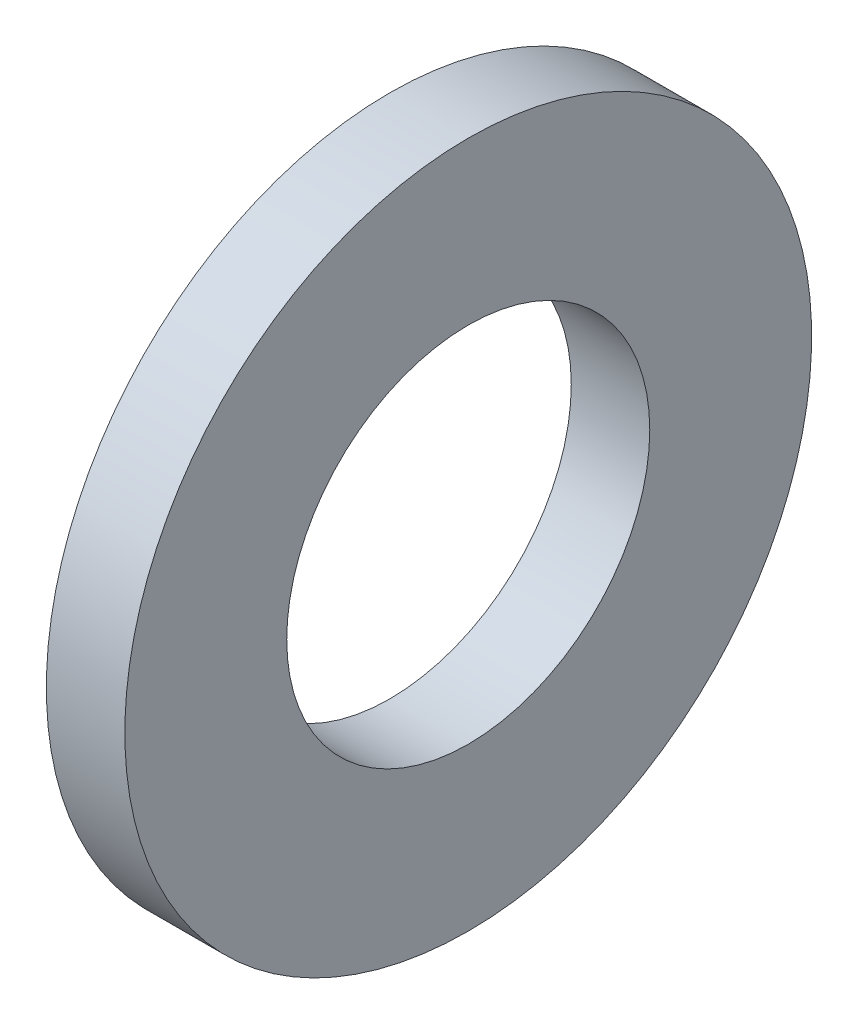
ISO-10303-21;
HEADER;
FILE_DESCRIPTION(('STEP AP214'),'2;1');
FILE_NAME('part.step','',(''),(''),'','','');
FILE_SCHEMA(('AUTOMOTIVE_DESIGN { 1 0 10303 214 1 1 1 1 }'));
ENDSEC;
DATA;
#1=APPLICATION_CONTEXT('core data for automotive mechanical design processes');
#2=APPLICATION_PROTOCOL_DEFINITION('international standard','automotive_design',2000,#1);
#3=PRODUCT_CONTEXT('',#1,'mechanical');
#4=PRODUCT('Part','Part','',(#3));
#5=PRODUCT_RELATED_PRODUCT_CATEGORY('part','',(#4));
#6=PRODUCT_DEFINITION_FORMATION('','',#4);
#7=PRODUCT_DEFINITION_CONTEXT('part definition',#1,'design');
#8=PRODUCT_DEFINITION('design','',#6,#7);
#9=PRODUCT_DEFINITION_SHAPE('','',#8);
#10=(LENGTH_UNIT() NAMED_UNIT(*) SI_UNIT(.MILLI.,.METRE.));
#11=(NAMED_UNIT(*) PLANE_ANGLE_UNIT() SI_UNIT($,.RADIAN.));
#12=(NAMED_UNIT(*) SI_UNIT($,.STERADIAN.) SOLID_ANGLE_UNIT());
#13=UNCERTAINTY_MEASURE_WITH_UNIT(LENGTH_MEASURE(1.E-05),#10,'distance_accuracy_value','');
#14=(GEOMETRIC_REPRESENTATION_CONTEXT(3) GLOBAL_UNCERTAINTY_ASSIGNED_CONTEXT((#13)) GLOBAL_UNIT_ASSIGNED_CONTEXT((#10,
#11,#12)) REPRESENTATION_CONTEXT('',''));
#15=CARTESIAN_POINT('',(0.,0.,0.));
#16=DIRECTION('',(0.,0.,1.));
#17=DIRECTION('',(1.,0.,0.));
#18=AXIS2_PLACEMENT_3D('',#15,#16,#17);
#19=CARTESIAN_POINT('',(0.,0.,0.));
#20=DIRECTION('',(-1.,0.,0.));
#21=DIRECTION('',(0.,0.,1.));
#22=AXIS2_PLACEMENT_3D('',#19,#20,#21);
#23=PLANE('',#22);
#24=CARTESIAN_POINT('',(0.,0.,0.));
#25=DIRECTION('',(-1.,0.,0.));
#26=DIRECTION('',(0.,-1.,0.));
#27=AXIS2_PLACEMENT_3D('',#24,#25,#26);
#28=CIRCLE('',#27,7.);
#29=CARTESIAN_POINT('',(0.,7.,0.));
#30=VERTEX_POINT('',#29);
#31=EDGE_CURVE('E11',#30,#30,#28,.T.);
#32=ORIENTED_EDGE('',*,*,#31,.T.);
#33=EDGE_LOOP('',(#32));
#34=FACE_BOUND('',#33,.T.);
#35=CARTESIAN_POINT('',(0.,0.,0.));
#36=DIRECTION('',(1.,0.,0.));
#37=DIRECTION('',(0.,-1.,0.));
#38=AXIS2_PLACEMENT_3D('',#35,#36,#37);
#39=CIRCLE('',#38,3.7);
#40=CARTESIAN_POINT('',(0.,3.7,0.));
#41=VERTEX_POINT('',#40);
#42=EDGE_CURVE('E54',#41,#41,#39,.T.);
#43=ORIENTED_EDGE('',*,*,#42,.T.);
#44=EDGE_LOOP('',(#43));
#45=FACE_BOUND('',#44,.T.);
#46=ADVANCED_FACE('F16',(#34,#45),#23,.T.);
#47=CARTESIAN_POINT('',(1.6,0.,0.));
#48=DIRECTION('',(-1.,0.,0.));
#49=DIRECTION('',(0.,0.,1.));
#50=AXIS2_PLACEMENT_3D('',#47,#48,#49);
#51=PLANE('',#50);
#52=CARTESIAN_POINT('',(1.6,0.,0.));
#53=DIRECTION('',(-1.,0.,0.));
#54=DIRECTION('',(0.,-1.,0.));
#55=AXIS2_PLACEMENT_3D('',#52,#53,#54);
#56=CIRCLE('',#55,7.);
#57=CARTESIAN_POINT('',(1.6,7.,0.));
#58=VERTEX_POINT('',#57);
#59=EDGE_CURVE('E25',#58,#58,#56,.T.);
#60=ORIENTED_EDGE('',*,*,#59,.F.);
#61=EDGE_LOOP('',(#60));
#62=FACE_BOUND('',#61,.T.);
#63=CARTESIAN_POINT('',(1.6,0.,0.));
#64=DIRECTION('',(-1.,0.,0.));
#65=DIRECTION('',(0.,-1.,0.));
#66=AXIS2_PLACEMENT_3D('',#63,#64,#65);
#67=CIRCLE('',#66,3.7);
#68=CARTESIAN_POINT('',(1.6,3.7,0.));
#69=VERTEX_POINT('',#68);
#70=EDGE_CURVE('E50',#69,#69,#67,.T.);
#71=ORIENTED_EDGE('',*,*,#70,.T.);
#72=EDGE_LOOP('',(#71));
#73=FACE_BOUND('',#72,.T.);
#74=ADVANCED_FACE('F51',(#62,#73),#51,.F.);
#75=CARTESIAN_POINT('',(0.,0.,0.));
#76=DIRECTION('',(1.,0.,0.));
#77=DIRECTION('',(0.,-1.,0.));
#78=AXIS2_PLACEMENT_3D('',#75,#76,#77);
#79=CYLINDRICAL_SURFACE('',#78,7.);
#80=ORIENTED_EDGE('',*,*,#31,.F.);
#81=EDGE_LOOP('',(#80));
#82=FACE_BOUND('',#81,.T.);
#83=ORIENTED_EDGE('',*,*,#59,.T.);
#84=EDGE_LOOP('',(#83));
#85=FACE_BOUND('',#84,.T.);
#86=ADVANCED_FACE('F18',(#82,#85),#79,.T.);
#87=CARTESIAN_POINT('',(0.,0.,0.));
#88=DIRECTION('',(1.,0.,0.));
#89=DIRECTION('',(0.,-1.,0.));
#90=AXIS2_PLACEMENT_3D('',#87,#88,#89);
#91=CYLINDRICAL_SURFACE('',#90,3.7);
#92=ORIENTED_EDGE('',*,*,#42,.F.);
#93=EDGE_LOOP('',(#92));
#94=FACE_BOUND('',#93,.T.);
#95=ORIENTED_EDGE('',*,*,#70,.F.);
#96=EDGE_LOOP('',(#95));
#97=FACE_BOUND('',#96,.T.);
#98=ADVANCED_FACE('F77',(#94,#97),#91,.F.);
#99=CLOSED_SHELL('',(#46,#74,#86,#98));
#100=MANIFOLD_SOLID_BREP('B1',#99);
#101=ADVANCED_BREP_SHAPE_REPRESENTATION('',(#18,#100),#14);
#102=SHAPE_DEFINITION_REPRESENTATION(#9,#101);
ENDSEC;
END-ISO-10303-21;
